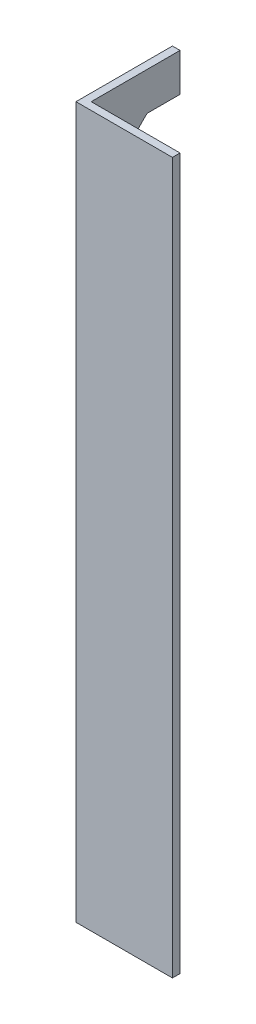
ISO-10303-21;
HEADER;
FILE_DESCRIPTION(('STEP AP214'),'2;1');
FILE_NAME('part.step','',(''),(''),'','','');
FILE_SCHEMA(('AUTOMOTIVE_DESIGN { 1 0 10303 214 1 1 1 1 }'));
ENDSEC;
DATA;
#1=APPLICATION_CONTEXT('core data for automotive mechanical design processes');
#2=APPLICATION_PROTOCOL_DEFINITION('international standard','automotive_design',2000,#1);
#3=PRODUCT_CONTEXT('',#1,'mechanical');
#4=PRODUCT('Part','Part','',(#3));
#5=PRODUCT_RELATED_PRODUCT_CATEGORY('part','',(#4));
#6=PRODUCT_DEFINITION_FORMATION('','',#4);
#7=PRODUCT_DEFINITION_CONTEXT('part definition',#1,'design');
#8=PRODUCT_DEFINITION('design','',#6,#7);
#9=PRODUCT_DEFINITION_SHAPE('','',#8);
#10=(LENGTH_UNIT() NAMED_UNIT(*) SI_UNIT(.MILLI.,.METRE.));
#11=(NAMED_UNIT(*) PLANE_ANGLE_UNIT() SI_UNIT($,.RADIAN.));
#12=(NAMED_UNIT(*) SI_UNIT($,.STERADIAN.) SOLID_ANGLE_UNIT());
#13=UNCERTAINTY_MEASURE_WITH_UNIT(LENGTH_MEASURE(1.E-05),#10,'distance_accuracy_value','');
#14=(GEOMETRIC_REPRESENTATION_CONTEXT(3) GLOBAL_UNCERTAINTY_ASSIGNED_CONTEXT((#13)) GLOBAL_UNIT_ASSIGNED_CONTEXT((#10,
#11,#12)) REPRESENTATION_CONTEXT('',''));
#15=CARTESIAN_POINT('',(0.,0.,0.));
#16=DIRECTION('',(0.,0.,1.));
#17=DIRECTION('',(1.,0.,0.));
#18=AXIS2_PLACEMENT_3D('',#15,#16,#17);
#19=CARTESIAN_POINT('',(6.66133814775094E-13,280.000000000001,-38.0000000000002));
#20=DIRECTION('',(0.,0.,1.00000000000001));
#21=DIRECTION('',(1.,0.,0.));
#22=AXIS2_PLACEMENT_3D('',#19,#20,#21);
#23=PLANE('',#22);
#24=DIRECTION('',(0.,-1.00000000000001,0.));
#25=VECTOR('',#24,1.);
#26=CARTESIAN_POINT('',(3.00000000000067,280.000000000001,-38.0000000000002));
#27=LINE('',#26,#25);
#28=CARTESIAN_POINT('',(3.00000000000067,280.000000000001,-38.0000000000002));
#29=VERTEX_POINT('',#28);
#30=CARTESIAN_POINT('',(3.00000000000067,265.000000000001,-38.0000000000002));
#31=VERTEX_POINT('',#30);
#32=EDGE_CURVE('E143',#29,#31,#27,.T.);
#33=ORIENTED_EDGE('',*,*,#32,.T.);
#34=DIRECTION('',(-1.,0.,0.));
#35=VECTOR('',#34,1.);
#36=CARTESIAN_POINT('',(254.055770696473,265.000000000001,-38.0000000000002));
#37=LINE('',#36,#35);
#38=CARTESIAN_POINT('',(6.66133814775094E-13,265.000000000001,-38.0000000000002));
#39=VERTEX_POINT('',#38);
#40=EDGE_CURVE('E129',#31,#39,#37,.T.);
#41=ORIENTED_EDGE('',*,*,#40,.T.);
#42=DIRECTION('',(0.,-1.00000000000001,0.));
#43=VECTOR('',#42,1.);
#44=CARTESIAN_POINT('',(6.66133814775094E-13,280.000000000001,-38.0000000000002));
#45=LINE('',#44,#43);
#46=CARTESIAN_POINT('',(6.66133814775094E-13,280.000000000001,-38.0000000000002));
#47=VERTEX_POINT('',#46);
#48=EDGE_CURVE('E140',#47,#39,#45,.T.);
#49=ORIENTED_EDGE('',*,*,#48,.F.);
#50=DIRECTION('',(-1.,0.,0.));
#51=VECTOR('',#50,1.);
#52=CARTESIAN_POINT('',(6.66133814775094E-13,280.000000000001,-38.0000000000002));
#53=LINE('',#52,#51);
#54=EDGE_CURVE('E244',#29,#47,#53,.T.);
#55=ORIENTED_EDGE('',*,*,#54,.F.);
#56=EDGE_LOOP('',(#33,#41,#49,#55));
#57=FACE_BOUND('',#56,.T.);
#58=ADVANCED_FACE('F38',(#57),#23,.F.);
#59=CARTESIAN_POINT('',(6.66133814775094E-13,280.000000000001,0.));
#60=DIRECTION('',(0.,0.,-1.00000000000001));
#61=DIRECTION('',(-1.,0.,0.));
#62=AXIS2_PLACEMENT_3D('',#59,#60,#61);
#63=PLANE('',#62);
#64=DIRECTION('',(1.,0.,0.));
#65=VECTOR('',#64,1.);
#66=CARTESIAN_POINT('',(0.,0.,0.));
#67=LINE('',#66,#65);
#68=CARTESIAN_POINT('',(0.,0.,0.));
#69=VERTEX_POINT('',#68);
#70=CARTESIAN_POINT('',(38.,6.93889390390723E-13,0.));
#71=VERTEX_POINT('',#70);
#72=EDGE_CURVE('E234',#69,#71,#67,.T.);
#73=ORIENTED_EDGE('',*,*,#72,.T.);
#74=DIRECTION('',(0.,-1.00000000000001,0.));
#75=VECTOR('',#74,1.);
#76=CARTESIAN_POINT('',(38.,280.000000000001,0.));
#77=LINE('',#76,#75);
#78=CARTESIAN_POINT('',(38.,280.000000000001,0.));
#79=VERTEX_POINT('',#78);
#80=EDGE_CURVE('E163',#79,#71,#77,.T.);
#81=ORIENTED_EDGE('',*,*,#80,.F.);
#82=DIRECTION('',(1.,0.,0.));
#83=VECTOR('',#82,1.);
#84=CARTESIAN_POINT('',(6.66133814775094E-13,280.000000000001,0.));
#85=LINE('',#84,#83);
#86=CARTESIAN_POINT('',(6.66133814775094E-13,280.000000000001,0.));
#87=VERTEX_POINT('',#86);
#88=EDGE_CURVE('E235',#87,#79,#85,.T.);
#89=ORIENTED_EDGE('',*,*,#88,.F.);
#90=DIRECTION('',(0.,-1.00000000000001,0.));
#91=VECTOR('',#90,1.);
#92=CARTESIAN_POINT('',(6.66133814775094E-13,280.000000000001,0.));
#93=LINE('',#92,#91);
#94=EDGE_CURVE('E153',#87,#69,#93,.T.);
#95=ORIENTED_EDGE('',*,*,#94,.T.);
#96=EDGE_LOOP('',(#73,#81,#89,#95));
#97=FACE_BOUND('',#96,.T.);
#98=ADVANCED_FACE('F193',(#97),#63,.F.);
#99=CARTESIAN_POINT('',(38.0000000000007,280.000000000001,-3.));
#100=DIRECTION('',(-1.,0.,0.));
#101=DIRECTION('',(0.,0.,1.00000000000001));
#102=AXIS2_PLACEMENT_3D('',#99,#100,#101);
#103=PLANE('',#102);
#104=DIRECTION('',(0.,0.,-1.00000000000001));
#105=VECTOR('',#104,1.);
#106=CARTESIAN_POINT('',(38.0000000000007,6.93889390390723E-13,-3.));
#107=LINE('',#106,#105);
#108=CARTESIAN_POINT('',(38.0000000000007,6.93889390390723E-13,-3.));
#109=VERTEX_POINT('',#108);
#110=EDGE_CURVE('E249',#71,#109,#107,.T.);
#111=ORIENTED_EDGE('',*,*,#110,.T.);
#112=DIRECTION('',(0.,-1.00000000000001,0.));
#113=VECTOR('',#112,1.);
#114=CARTESIAN_POINT('',(38.0000000000007,280.000000000001,-3.));
#115=LINE('',#114,#113);
#116=CARTESIAN_POINT('',(38.0000000000007,280.000000000001,-3.));
#117=VERTEX_POINT('',#116);
#118=EDGE_CURVE('E160',#117,#109,#115,.T.);
#119=ORIENTED_EDGE('',*,*,#118,.F.);
#120=DIRECTION('',(0.,0.,-1.00000000000001));
#121=VECTOR('',#120,1.);
#122=CARTESIAN_POINT('',(38.0000000000007,280.000000000001,-3.));
#123=LINE('',#122,#121);
#124=EDGE_CURVE('E238',#79,#117,#123,.T.);
#125=ORIENTED_EDGE('',*,*,#124,.F.);
#126=ORIENTED_EDGE('',*,*,#80,.T.);
#127=EDGE_LOOP('',(#111,#119,#125,#126));
#128=FACE_BOUND('',#127,.T.);
#129=ADVANCED_FACE('F199',(#128),#103,.F.);
#130=CARTESIAN_POINT('',(3.00000000000067,280.000000000001,-3.));
#131=DIRECTION('',(0.,0.,1.00000000000001));
#132=DIRECTION('',(1.,0.,0.));
#133=AXIS2_PLACEMENT_3D('',#130,#131,#132);
#134=PLANE('',#133);
#135=DIRECTION('',(-1.,0.,0.));
#136=VECTOR('',#135,1.);
#137=CARTESIAN_POINT('',(3.0000000000007,0.,-3.));
#138=LINE('',#137,#136);
#139=CARTESIAN_POINT('',(3.0000000000007,0.,-3.));
#140=VERTEX_POINT('',#139);
#141=EDGE_CURVE('E251',#109,#140,#138,.T.);
#142=ORIENTED_EDGE('',*,*,#141,.T.);
#143=DIRECTION('',(0.,-1.00000000000001,0.));
#144=VECTOR('',#143,1.);
#145=CARTESIAN_POINT('',(3.00000000000067,280.000000000001,-3.));
#146=LINE('',#145,#144);
#147=CARTESIAN_POINT('',(3.00000000000067,280.000000000001,-3.));
#148=VERTEX_POINT('',#147);
#149=EDGE_CURVE('E157',#148,#140,#146,.T.);
#150=ORIENTED_EDGE('',*,*,#149,.F.);
#151=DIRECTION('',(-1.,0.,0.));
#152=VECTOR('',#151,1.);
#153=CARTESIAN_POINT('',(3.00000000000067,280.000000000001,-3.));
#154=LINE('',#153,#152);
#155=EDGE_CURVE('E240',#117,#148,#154,.T.);
#156=ORIENTED_EDGE('',*,*,#155,.F.);
#157=ORIENTED_EDGE('',*,*,#118,.T.);
#158=EDGE_LOOP('',(#142,#150,#156,#157));
#159=FACE_BOUND('',#158,.T.);
#160=ADVANCED_FACE('F212',(#159),#134,.F.);
#161=CARTESIAN_POINT('',(3.00000000000067,280.000000000001,-3.));
#162=DIRECTION('',(-1.,0.,0.));
#163=DIRECTION('',(0.,0.,1.00000000000001));
#164=AXIS2_PLACEMENT_3D('',#161,#162,#163);
#165=PLANE('',#164);
#166=DIRECTION('',(0.,-1.00000000000001,0.));
#167=VECTOR('',#166,1.);
#168=CARTESIAN_POINT('',(3.,15.,-15.0000000000001));
#169=LINE('',#168,#167);
#170=CARTESIAN_POINT('',(3.00000000000131,255.000000000001,-15.0000000000002));
#171=VERTEX_POINT('',#170);
#172=CARTESIAN_POINT('',(3.00000000000067,25.0000000000001,-15.0000000000001));
#173=VERTEX_POINT('',#172);
#174=EDGE_CURVE('E144',#171,#173,#169,.T.);
#175=ORIENTED_EDGE('',*,*,#174,.F.);
#176=DIRECTION('',(0.,-0.707106781186546,0.707106781186554));
#177=VECTOR('',#176,1.);
#178=CARTESIAN_POINT('',(3.,261.500000000001,-21.5));
#179=LINE('',#178,#177);
#180=CARTESIAN_POINT('',(3.00000000000067,265.000000000001,-25.0000000000002));
#181=VERTEX_POINT('',#180);
#182=EDGE_CURVE('E11',#171,#181,#179,.F.);
#183=ORIENTED_EDGE('',*,*,#182,.T.);
#184=DIRECTION('',(0.,0.,1.00000000000001));
#185=VECTOR('',#184,1.);
#186=CARTESIAN_POINT('',(3.00000000000067,265.000000000001,-15.0000000000002));
#187=LINE('',#186,#185);
#188=EDGE_CURVE('E228',#31,#181,#187,.T.);
#189=ORIENTED_EDGE('',*,*,#188,.F.);
#190=ORIENTED_EDGE('',*,*,#32,.F.);
#191=DIRECTION('',(0.,0.,-1.00000000000001));
#192=VECTOR('',#191,1.);
#193=CARTESIAN_POINT('',(3.00000000000067,280.000000000001,-3.));
#194=LINE('',#193,#192);
#195=EDGE_CURVE('E242',#148,#29,#194,.T.);
#196=ORIENTED_EDGE('',*,*,#195,.F.);
#197=ORIENTED_EDGE('',*,*,#149,.T.);
#198=DIRECTION('',(0.,0.,-1.00000000000001));
#199=VECTOR('',#198,1.);
#200=CARTESIAN_POINT('',(3.0000000000007,0.,-3.));
#201=LINE('',#200,#199);
#202=CARTESIAN_POINT('',(3.00000000000064,0.,-38.0000000000002));
#203=VERTEX_POINT('',#202);
#204=EDGE_CURVE('E253',#140,#203,#201,.T.);
#205=ORIENTED_EDGE('',*,*,#204,.T.);
#206=CARTESIAN_POINT('',(3.,15.,-38.0000000000002));
#207=VERTEX_POINT('',#206);
#208=EDGE_CURVE('E149',#207,#203,#27,.T.);
#209=ORIENTED_EDGE('',*,*,#208,.F.);
#210=DIRECTION('',(0.,0.,-1.00000000000001));
#211=VECTOR('',#210,1.);
#212=CARTESIAN_POINT('',(3.,15.,-38.0000000000002));
#213=LINE('',#212,#211);
#214=CARTESIAN_POINT('',(3.,15.,-25.0000000000001));
#215=VERTEX_POINT('',#214);
#216=EDGE_CURVE('E232',#215,#207,#213,.T.);
#217=ORIENTED_EDGE('',*,*,#216,.F.);
#218=DIRECTION('',(0.,-0.707106781186553,-0.707106781186547));
#219=VECTOR('',#218,1.);
#220=CARTESIAN_POINT('',(3.,158.500000000003,118.500000000001));
#221=LINE('',#220,#219);
#222=EDGE_CURVE('E176',#215,#173,#221,.F.);
#223=ORIENTED_EDGE('',*,*,#222,.T.);
#224=EDGE_LOOP('',(#175,#183,#189,#190,#196,#197,#205,#209,#217,#223));
#225=FACE_BOUND('',#224,.T.);
#226=ADVANCED_FACE('F205',(#225),#165,.F.);
#227=CARTESIAN_POINT('',(0.,15.,-38.0000000000002));
#228=VERTEX_POINT('',#227);
#229=CARTESIAN_POINT('',(6.38378239159465E-13,0.,-38.0000000000002));
#230=VERTEX_POINT('',#229);
#231=EDGE_CURVE('E150',#228,#230,#45,.T.);
#232=ORIENTED_EDGE('',*,*,#231,.F.);
#233=DIRECTION('',(-1.,0.,0.));
#234=VECTOR('',#233,1.);
#235=CARTESIAN_POINT('',(254.055770696473,15.,-38.0000000000002));
#236=LINE('',#235,#234);
#237=EDGE_CURVE('E133',#207,#228,#236,.T.);
#238=ORIENTED_EDGE('',*,*,#237,.F.);
#239=ORIENTED_EDGE('',*,*,#208,.T.);
#240=DIRECTION('',(-1.,0.,0.));
#241=VECTOR('',#240,1.);
#242=CARTESIAN_POINT('',(6.38378239159465E-13,0.,-38.0000000000002));
#243=LINE('',#242,#241);
#244=EDGE_CURVE('E218',#203,#230,#243,.T.);
#245=ORIENTED_EDGE('',*,*,#244,.T.);
#246=EDGE_LOOP('',(#232,#238,#239,#245));
#247=FACE_BOUND('',#246,.T.);
#248=ADVANCED_FACE('F195',(#247),#23,.F.);
#249=CARTESIAN_POINT('',(6.66133814775094E-13,280.000000000001,0.));
#250=DIRECTION('',(1.,0.,0.));
#251=DIRECTION('',(0.,0.,-1.00000000000001));
#252=AXIS2_PLACEMENT_3D('',#249,#250,#251);
#253=PLANE('',#252);
#254=ORIENTED_EDGE('',*,*,#48,.T.);
#255=DIRECTION('',(0.,0.,-1.00000000000001));
#256=VECTOR('',#255,1.);
#257=CARTESIAN_POINT('',(6.66133814775094E-13,265.000000000001,-15.0000000000001));
#258=LINE('',#257,#256);
#259=CARTESIAN_POINT('',(6.66133814775094E-13,265.000000000001,-25.0000000000002));
#260=VERTEX_POINT('',#259);
#261=EDGE_CURVE('E126',#260,#39,#258,.T.);
#262=ORIENTED_EDGE('',*,*,#261,.F.);
#263=DIRECTION('',(0.,0.707106781186546,-0.707106781186554));
#264=VECTOR('',#263,1.);
#265=CARTESIAN_POINT('',(6.66133814775094E-13,260.000000000001,-20.));
#266=LINE('',#265,#264);
#267=CARTESIAN_POINT('',(1.30451205393456E-12,255.000000000001,-15.0000000000001));
#268=VERTEX_POINT('',#267);
#269=EDGE_CURVE('E46',#260,#268,#266,.F.);
#270=ORIENTED_EDGE('',*,*,#269,.T.);
#271=DIRECTION('',(0.,1.00000000000001,0.));
#272=VECTOR('',#271,1.);
#273=CARTESIAN_POINT('',(0.,15.,-15.0000000000001));
#274=LINE('',#273,#272);
#275=CARTESIAN_POINT('',(6.66133814775094E-13,25.0000000000001,-15.0000000000001));
#276=VERTEX_POINT('',#275);
#277=EDGE_CURVE('E134',#276,#268,#274,.T.);
#278=ORIENTED_EDGE('',*,*,#277,.F.);
#279=DIRECTION('',(0.,0.707106781186553,0.707106781186547));
#280=VECTOR('',#279,1.);
#281=CARTESIAN_POINT('',(6.93889390390723E-13,160.000000000002,120.000000000001));
#282=LINE('',#281,#280);
#283=CARTESIAN_POINT('',(0.,15.,-25.0000000000001));
#284=VERTEX_POINT('',#283);
#285=EDGE_CURVE('E174',#276,#284,#282,.F.);
#286=ORIENTED_EDGE('',*,*,#285,.T.);
#287=DIRECTION('',(0.,0.,1.00000000000001));
#288=VECTOR('',#287,1.);
#289=CARTESIAN_POINT('',(0.,15.,-38.0000000000002));
#290=LINE('',#289,#288);
#291=EDGE_CURVE('E183',#228,#284,#290,.T.);
#292=ORIENTED_EDGE('',*,*,#291,.F.);
#293=ORIENTED_EDGE('',*,*,#231,.T.);
#294=DIRECTION('',(0.,0.,1.00000000000001));
#295=VECTOR('',#294,1.);
#296=CARTESIAN_POINT('',(0.,0.,0.));
#297=LINE('',#296,#295);
#298=EDGE_CURVE('E221',#230,#69,#297,.T.);
#299=ORIENTED_EDGE('',*,*,#298,.T.);
#300=ORIENTED_EDGE('',*,*,#94,.F.);
#301=DIRECTION('',(0.,0.,1.00000000000001));
#302=VECTOR('',#301,1.);
#303=CARTESIAN_POINT('',(6.66133814775094E-13,280.000000000001,0.));
#304=LINE('',#303,#302);
#305=EDGE_CURVE('E148',#47,#87,#304,.T.);
#306=ORIENTED_EDGE('',*,*,#305,.F.);
#307=EDGE_LOOP('',(#254,#262,#270,#278,#286,#292,#293,#299,#300,#306));
#308=FACE_BOUND('',#307,.T.);
#309=ADVANCED_FACE('F146',(#308),#253,.F.);
#310=CARTESIAN_POINT('',(6.66133814775094E-13,280.000000000001,0.));
#311=DIRECTION('',(0.,-1.00000000000001,0.));
#312=DIRECTION('',(0.,0.,-1.00000000000001));
#313=AXIS2_PLACEMENT_3D('',#310,#311,#312);
#314=PLANE('',#313);
#315=ORIENTED_EDGE('',*,*,#88,.T.);
#316=ORIENTED_EDGE('',*,*,#124,.T.);
#317=ORIENTED_EDGE('',*,*,#155,.T.);
#318=ORIENTED_EDGE('',*,*,#195,.T.);
#319=ORIENTED_EDGE('',*,*,#54,.T.);
#320=ORIENTED_EDGE('',*,*,#305,.T.);
#321=EDGE_LOOP('',(#315,#316,#317,#318,#319,#320));
#322=FACE_BOUND('',#321,.T.);
#323=ADVANCED_FACE('F211',(#322),#314,.F.);
#324=CARTESIAN_POINT('',(0.,0.,0.));
#325=DIRECTION('',(0.,-1.00000000000001,0.));
#326=DIRECTION('',(0.,0.,-1.00000000000001));
#327=AXIS2_PLACEMENT_3D('',#324,#325,#326);
#328=PLANE('',#327);
#329=ORIENTED_EDGE('',*,*,#72,.F.);
#330=ORIENTED_EDGE('',*,*,#298,.F.);
#331=ORIENTED_EDGE('',*,*,#244,.F.);
#332=ORIENTED_EDGE('',*,*,#204,.F.);
#333=ORIENTED_EDGE('',*,*,#141,.F.);
#334=ORIENTED_EDGE('',*,*,#110,.F.);
#335=EDGE_LOOP('',(#329,#330,#331,#332,#333,#334));
#336=FACE_BOUND('',#335,.T.);
#337=ADVANCED_FACE('F263',(#336),#328,.T.);
#338=CARTESIAN_POINT('',(254.055770696473,265.000000000001,-15.0000000000001));
#339=DIRECTION('',(0.,1.00000000000001,0.));
#340=DIRECTION('',(0.,0.,1.00000000000001));
#341=AXIS2_PLACEMENT_3D('',#338,#339,#340);
#342=PLANE('',#341);
#343=ORIENTED_EDGE('',*,*,#188,.T.);
#344=DIRECTION('',(-1.,0.,0.));
#345=VECTOR('',#344,1.);
#346=CARTESIAN_POINT('',(6.66133814775094E-13,265.000000000001,-25.0000000000002));
#347=LINE('',#346,#345);
#348=EDGE_CURVE('E130',#181,#260,#347,.T.);
#349=ORIENTED_EDGE('',*,*,#348,.T.);
#350=ORIENTED_EDGE('',*,*,#261,.T.);
#351=ORIENTED_EDGE('',*,*,#40,.F.);
#352=EDGE_LOOP('',(#343,#349,#350,#351));
#353=FACE_BOUND('',#352,.T.);
#354=ADVANCED_FACE('F128',(#353),#342,.F.);
#355=CARTESIAN_POINT('',(254.055770696474,15.,-15.0000000000001));
#356=DIRECTION('',(0.,0.,1.00000000000001));
#357=DIRECTION('',(0.,-1.00000000000001,0.));
#358=AXIS2_PLACEMENT_3D('',#355,#356,#357);
#359=PLANE('',#358);
#360=ORIENTED_EDGE('',*,*,#174,.T.);
#361=DIRECTION('',(-1.,0.,0.));
#362=VECTOR('',#361,1.);
#363=CARTESIAN_POINT('',(6.66133814775094E-13,25.0000000000001,-15.0000000000001));
#364=LINE('',#363,#362);
#365=EDGE_CURVE('E168',#173,#276,#364,.T.);
#366=ORIENTED_EDGE('',*,*,#365,.T.);
#367=ORIENTED_EDGE('',*,*,#277,.T.);
#368=DIRECTION('',(1.,0.,0.));
#369=VECTOR('',#368,1.);
#370=CARTESIAN_POINT('',(3.00000000000131,255.000000000001,-15.0000000000002));
#371=LINE('',#370,#369);
#372=EDGE_CURVE('E166',#268,#171,#371,.T.);
#373=ORIENTED_EDGE('',*,*,#372,.T.);
#374=EDGE_LOOP('',(#360,#366,#367,#373));
#375=FACE_BOUND('',#374,.T.);
#376=ADVANCED_FACE('F181',(#375),#359,.F.);
#377=CARTESIAN_POINT('',(254.055770696473,15.,-38.0000000000002));
#378=DIRECTION('',(0.,-1.00000000000001,0.));
#379=DIRECTION('',(0.,0.,-1.00000000000001));
#380=AXIS2_PLACEMENT_3D('',#377,#378,#379);
#381=PLANE('',#380);
#382=ORIENTED_EDGE('',*,*,#291,.T.);
#383=DIRECTION('',(1.,0.,0.));
#384=VECTOR('',#383,1.);
#385=CARTESIAN_POINT('',(3.,15.,-25.0000000000001));
#386=LINE('',#385,#384);
#387=EDGE_CURVE('E171',#284,#215,#386,.T.);
#388=ORIENTED_EDGE('',*,*,#387,.T.);
#389=ORIENTED_EDGE('',*,*,#216,.T.);
#390=ORIENTED_EDGE('',*,*,#237,.T.);
#391=EDGE_LOOP('',(#382,#388,#389,#390));
#392=FACE_BOUND('',#391,.T.);
#393=ADVANCED_FACE('F190',(#392),#381,.F.);
#394=CARTESIAN_POINT('',(254.055770696473,25.,-15.0000000000001));
#395=DIRECTION('',(0.,0.707106781186547,-0.707106781186553));
#396=DIRECTION('',(1.,0.,0.));
#397=AXIS2_PLACEMENT_3D('',#394,#395,#396);
#398=PLANE('',#397);
#399=ORIENTED_EDGE('',*,*,#222,.F.);
#400=ORIENTED_EDGE('',*,*,#387,.F.);
#401=ORIENTED_EDGE('',*,*,#285,.F.);
#402=ORIENTED_EDGE('',*,*,#365,.F.);
#403=EDGE_LOOP('',(#399,#400,#401,#402));
#404=FACE_BOUND('',#403,.T.);
#405=ADVANCED_FACE('F186',(#404),#398,.T.);
#406=CARTESIAN_POINT('',(254.055770696473,265.000000000001,-25.0000000000002));
#407=DIRECTION('',(0.,-0.707106781186554,-0.707106781186546));
#408=DIRECTION('',(1.,0.,0.));
#409=AXIS2_PLACEMENT_3D('',#406,#407,#408);
#410=PLANE('',#409);
#411=ORIENTED_EDGE('',*,*,#182,.F.);
#412=ORIENTED_EDGE('',*,*,#372,.F.);
#413=ORIENTED_EDGE('',*,*,#269,.F.);
#414=ORIENTED_EDGE('',*,*,#348,.F.);
#415=EDGE_LOOP('',(#411,#412,#413,#414));
#416=FACE_BOUND('',#415,.T.);
#417=ADVANCED_FACE('F40',(#416),#410,.T.);
#418=CLOSED_SHELL('',(#58,#98,#129,#160,#226,#248,#309,#323,#337,#354,#376,#393,#405,#417));
#419=MANIFOLD_SOLID_BREP('B2',#418);
#420=ADVANCED_BREP_SHAPE_REPRESENTATION('',(#18,#419),#14);
#421=SHAPE_DEFINITION_REPRESENTATION(#9,#420);
ENDSEC;
END-ISO-10303-21;
